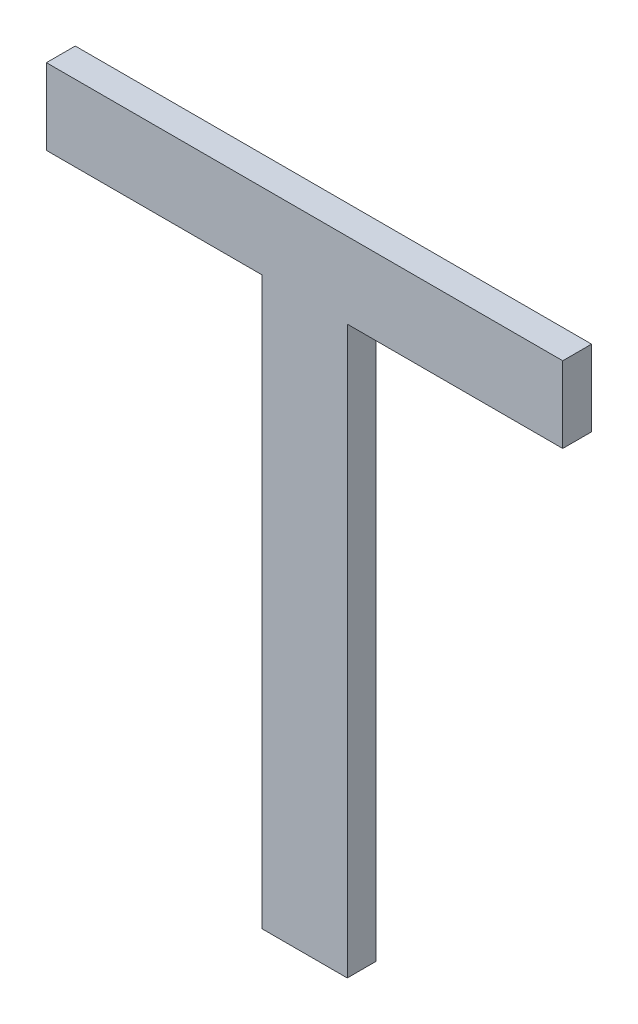
ISO-10303-21;
HEADER;
FILE_DESCRIPTION(('STEP AP214'),'2;1');
FILE_NAME('part.step','',(''),(''),'','','');
FILE_SCHEMA(('AUTOMOTIVE_DESIGN { 1 0 10303 214 1 1 1 1 }'));
ENDSEC;
DATA;
#1=APPLICATION_CONTEXT('core data for automotive mechanical design processes');
#2=APPLICATION_PROTOCOL_DEFINITION('international standard','automotive_design',2000,#1);
#3=PRODUCT_CONTEXT('',#1,'mechanical');
#4=PRODUCT('Part','Part','',(#3));
#5=PRODUCT_RELATED_PRODUCT_CATEGORY('part','',(#4));
#6=PRODUCT_DEFINITION_FORMATION('','',#4);
#7=PRODUCT_DEFINITION_CONTEXT('part definition',#1,'design');
#8=PRODUCT_DEFINITION('design','',#6,#7);
#9=PRODUCT_DEFINITION_SHAPE('','',#8);
#10=(LENGTH_UNIT() NAMED_UNIT(*) SI_UNIT(.MILLI.,.METRE.));
#11=(NAMED_UNIT(*) PLANE_ANGLE_UNIT() SI_UNIT($,.RADIAN.));
#12=(NAMED_UNIT(*) SI_UNIT($,.STERADIAN.) SOLID_ANGLE_UNIT());
#13=UNCERTAINTY_MEASURE_WITH_UNIT(LENGTH_MEASURE(1.E-05),#10,'distance_accuracy_value','');
#14=(GEOMETRIC_REPRESENTATION_CONTEXT(3) GLOBAL_UNCERTAINTY_ASSIGNED_CONTEXT((#13)) GLOBAL_UNIT_ASSIGNED_CONTEXT((#10,
#11,#12)) REPRESENTATION_CONTEXT('',''));
#15=CARTESIAN_POINT('',(0.,0.,0.));
#16=DIRECTION('',(0.,0.,1.));
#17=DIRECTION('',(1.,0.,0.));
#18=AXIS2_PLACEMENT_3D('',#15,#16,#17);
#19=CARTESIAN_POINT('',(-1.2306951468241,-1.3211356147784,0.00415));
#20=DIRECTION('',(0.,0.,1.));
#21=DIRECTION('',(1.,0.,0.));
#22=AXIS2_PLACEMENT_3D('',#19,#20,#21);
#23=PLANE('',#22);
#24=DIRECTION('',(0.,-1.,0.));
#25=VECTOR('',#24,1.);
#26=CARTESIAN_POINT('',(-1.23557926339,-1.3051342008671,0.00415));
#27=LINE('',#26,#25);
#28=CARTESIAN_POINT('',(-1.23557926339,-1.3051342008671,0.00415));
#29=VERTEX_POINT('',#28);
#30=CARTESIAN_POINT('',(-1.23557926339,-1.3699380889616,0.00415));
#31=VERTEX_POINT('',#30);
#32=EDGE_CURVE('E11',#29,#31,#27,.T.);
#33=ORIENTED_EDGE('',*,*,#32,.T.);
#34=DIRECTION('',(1.,0.,0.));
#35=VECTOR('',#34,1.);
#36=CARTESIAN_POINT('',(-1.23557926339,-1.3699380889616,0.00415));
#37=LINE('',#36,#35);
#38=CARTESIAN_POINT('',(-1.2258110302581,-1.3699380889616,0.00415));
#39=VERTEX_POINT('',#38);
#40=EDGE_CURVE('E24',#31,#39,#37,.T.);
#41=ORIENTED_EDGE('',*,*,#40,.T.);
#42=DIRECTION('',(0.,1.,0.));
#43=VECTOR('',#42,1.);
#44=CARTESIAN_POINT('',(-1.2258110302581,-1.3699380889616,0.00415));
#45=LINE('',#44,#43);
#46=CARTESIAN_POINT('',(-1.2258110302581,-1.3051342008671,0.00415));
#47=VERTEX_POINT('',#46);
#48=EDGE_CURVE('E136',#39,#47,#45,.T.);
#49=ORIENTED_EDGE('',*,*,#48,.T.);
#50=DIRECTION('',(1.,0.,0.));
#51=VECTOR('',#50,1.);
#52=CARTESIAN_POINT('',(-1.2258110302581,-1.3051342008671,0.00415));
#53=LINE('',#52,#51);
#54=CARTESIAN_POINT('',(-1.2011521978398,-1.3051342008671,0.00415));
#55=VERTEX_POINT('',#54);
#56=EDGE_CURVE('E134',#47,#55,#53,.T.);
#57=ORIENTED_EDGE('',*,*,#56,.T.);
#58=DIRECTION('',(0.,1.,0.));
#59=VECTOR('',#58,1.);
#60=CARTESIAN_POINT('',(-1.2011521978398,-1.3051342008671,0.00415));
#61=LINE('',#60,#59);
#62=CARTESIAN_POINT('',(-1.2011521978398,-1.2964380908838,0.00415));
#63=VERTEX_POINT('',#62);
#64=EDGE_CURVE('E132',#55,#63,#61,.T.);
#65=ORIENTED_EDGE('',*,*,#64,.T.);
#66=DIRECTION('',(-1.,0.,0.));
#67=VECTOR('',#66,1.);
#68=CARTESIAN_POINT('',(-1.2011521978398,-1.2964380908838,0.00415));
#69=LINE('',#68,#67);
#70=CARTESIAN_POINT('',(-1.2602380958083,-1.2964380908838,0.00415));
#71=VERTEX_POINT('',#70);
#72=EDGE_CURVE('E130',#63,#71,#69,.T.);
#73=ORIENTED_EDGE('',*,*,#72,.T.);
#74=DIRECTION('',(0.,-1.,0.));
#75=VECTOR('',#74,1.);
#76=CARTESIAN_POINT('',(-1.2602380958083,-1.2964380908838,0.00415));
#77=LINE('',#76,#75);
#78=CARTESIAN_POINT('',(-1.2602380958083,-1.3051342008671,0.00415));
#79=VERTEX_POINT('',#78);
#80=EDGE_CURVE('E128',#71,#79,#77,.T.);
#81=ORIENTED_EDGE('',*,*,#80,.T.);
#82=DIRECTION('',(1.,0.,0.));
#83=VECTOR('',#82,1.);
#84=CARTESIAN_POINT('',(-1.2602380958083,-1.3051342008671,0.00415));
#85=LINE('',#84,#83);
#86=EDGE_CURVE('E126',#79,#29,#85,.T.);
#87=ORIENTED_EDGE('',*,*,#86,.T.);
#88=EDGE_LOOP('',(#33,#41,#49,#57,#65,#73,#81,#87));
#89=FACE_BOUND('',#88,.T.);
#90=ADVANCED_FACE('F17',(#89),#23,.T.);
#91=CARTESIAN_POINT('',(-1.2602380958083,-1.3051342008671,0.00085));
#92=DIRECTION('',(0.,-1.,0.));
#93=DIRECTION('',(1.,0.,0.));
#94=AXIS2_PLACEMENT_3D('',#91,#92,#93);
#95=PLANE('',#94);
#96=DIRECTION('',(-1.,0.,0.));
#97=VECTOR('',#96,1.);
#98=CARTESIAN_POINT('',(-1.23557926339,-1.3051342008671,0.00085));
#99=LINE('',#98,#97);
#100=CARTESIAN_POINT('',(-1.23557926339,-1.3051342008671,0.00085));
#101=VERTEX_POINT('',#100);
#102=CARTESIAN_POINT('',(-1.2602380958083,-1.3051342008671,0.00085));
#103=VERTEX_POINT('',#102);
#104=EDGE_CURVE('E124',#101,#103,#99,.T.);
#105=ORIENTED_EDGE('',*,*,#104,.F.);
#106=DIRECTION('',(0.,0.,1.));
#107=VECTOR('',#106,1.);
#108=CARTESIAN_POINT('',(-1.23557926339,-1.3051342008671,0.00085));
#109=LINE('',#108,#107);
#110=EDGE_CURVE('E95',#101,#29,#109,.T.);
#111=ORIENTED_EDGE('',*,*,#110,.T.);
#112=ORIENTED_EDGE('',*,*,#86,.F.);
#113=DIRECTION('',(0.,0.,1.));
#114=VECTOR('',#113,1.);
#115=CARTESIAN_POINT('',(-1.2602380958083,-1.3051342008671,0.00085));
#116=LINE('',#115,#114);
#117=EDGE_CURVE('E120',#103,#79,#116,.T.);
#118=ORIENTED_EDGE('',*,*,#117,.F.);
#119=EDGE_LOOP('',(#105,#111,#112,#118));
#120=FACE_BOUND('',#119,.T.);
#121=ADVANCED_FACE('F163',(#120),#95,.T.);
#122=CARTESIAN_POINT('',(-1.2602380958083,-1.2964380908838,0.00085));
#123=DIRECTION('',(-1.,0.,0.));
#124=DIRECTION('',(0.,-1.,0.));
#125=AXIS2_PLACEMENT_3D('',#122,#123,#124);
#126=PLANE('',#125);
#127=DIRECTION('',(0.,1.,0.));
#128=VECTOR('',#127,1.);
#129=CARTESIAN_POINT('',(-1.2602380958083,-1.3051342008671,0.00085));
#130=LINE('',#129,#128);
#131=CARTESIAN_POINT('',(-1.2602380958083,-1.2964380908838,0.00085));
#132=VERTEX_POINT('',#131);
#133=EDGE_CURVE('E118',#103,#132,#130,.T.);
#134=ORIENTED_EDGE('',*,*,#133,.F.);
#135=ORIENTED_EDGE('',*,*,#117,.T.);
#136=ORIENTED_EDGE('',*,*,#80,.F.);
#137=DIRECTION('',(0.,0.,1.));
#138=VECTOR('',#137,1.);
#139=CARTESIAN_POINT('',(-1.2602380958083,-1.2964380908838,0.00085));
#140=LINE('',#139,#138);
#141=EDGE_CURVE('E115',#132,#71,#140,.T.);
#142=ORIENTED_EDGE('',*,*,#141,.F.);
#143=EDGE_LOOP('',(#134,#135,#136,#142));
#144=FACE_BOUND('',#143,.T.);
#145=ADVANCED_FACE('F160',(#144),#126,.T.);
#146=CARTESIAN_POINT('',(-1.2011521978398,-1.2964380908838,0.00085));
#147=DIRECTION('',(0.,1.,0.));
#148=DIRECTION('',(-1.,0.,0.));
#149=AXIS2_PLACEMENT_3D('',#146,#147,#148);
#150=PLANE('',#149);
#151=DIRECTION('',(1.,0.,0.));
#152=VECTOR('',#151,1.);
#153=CARTESIAN_POINT('',(-1.2602380958083,-1.2964380908838,0.00085));
#154=LINE('',#153,#152);
#155=CARTESIAN_POINT('',(-1.2011521978398,-1.2964380908838,0.00085));
#156=VERTEX_POINT('',#155);
#157=EDGE_CURVE('E113',#132,#156,#154,.T.);
#158=ORIENTED_EDGE('',*,*,#157,.F.);
#159=ORIENTED_EDGE('',*,*,#141,.T.);
#160=ORIENTED_EDGE('',*,*,#72,.F.);
#161=DIRECTION('',(0.,0.,1.));
#162=VECTOR('',#161,1.);
#163=CARTESIAN_POINT('',(-1.2011521978398,-1.2964380908838,0.00085));
#164=LINE('',#163,#162);
#165=EDGE_CURVE('E110',#156,#63,#164,.T.);
#166=ORIENTED_EDGE('',*,*,#165,.F.);
#167=EDGE_LOOP('',(#158,#159,#160,#166));
#168=FACE_BOUND('',#167,.T.);
#169=ADVANCED_FACE('F154',(#168),#150,.T.);
#170=CARTESIAN_POINT('',(-1.2011521978398,-1.3051342008671,0.00085));
#171=DIRECTION('',(1.,0.,0.));
#172=DIRECTION('',(0.,1.,0.));
#173=AXIS2_PLACEMENT_3D('',#170,#171,#172);
#174=PLANE('',#173);
#175=DIRECTION('',(0.,-1.,0.));
#176=VECTOR('',#175,1.);
#177=CARTESIAN_POINT('',(-1.2011521978398,-1.2964380908838,0.00085));
#178=LINE('',#177,#176);
#179=CARTESIAN_POINT('',(-1.2011521978398,-1.3051342008671,0.00085));
#180=VERTEX_POINT('',#179);
#181=EDGE_CURVE('E108',#156,#180,#178,.T.);
#182=ORIENTED_EDGE('',*,*,#181,.F.);
#183=ORIENTED_EDGE('',*,*,#165,.T.);
#184=ORIENTED_EDGE('',*,*,#64,.F.);
#185=DIRECTION('',(0.,0.,1.));
#186=VECTOR('',#185,1.);
#187=CARTESIAN_POINT('',(-1.2011521978398,-1.3051342008671,0.00085));
#188=LINE('',#187,#186);
#189=EDGE_CURVE('E105',#180,#55,#188,.T.);
#190=ORIENTED_EDGE('',*,*,#189,.F.);
#191=EDGE_LOOP('',(#182,#183,#184,#190));
#192=FACE_BOUND('',#191,.T.);
#193=ADVANCED_FACE('F150',(#192),#174,.T.);
#194=CARTESIAN_POINT('',(-1.2258110302581,-1.3051342008671,0.00085));
#195=DIRECTION('',(0.,-1.,0.));
#196=DIRECTION('',(1.,0.,0.));
#197=AXIS2_PLACEMENT_3D('',#194,#195,#196);
#198=PLANE('',#197);
#199=DIRECTION('',(-1.,0.,0.));
#200=VECTOR('',#199,1.);
#201=CARTESIAN_POINT('',(-1.2011521978398,-1.3051342008671,0.00085));
#202=LINE('',#201,#200);
#203=CARTESIAN_POINT('',(-1.2258110302581,-1.3051342008671,0.00085));
#204=VERTEX_POINT('',#203);
#205=EDGE_CURVE('E103',#180,#204,#202,.T.);
#206=ORIENTED_EDGE('',*,*,#205,.F.);
#207=ORIENTED_EDGE('',*,*,#189,.T.);
#208=ORIENTED_EDGE('',*,*,#56,.F.);
#209=DIRECTION('',(0.,0.,1.));
#210=VECTOR('',#209,1.);
#211=CARTESIAN_POINT('',(-1.2258110302581,-1.3051342008671,0.00085));
#212=LINE('',#211,#210);
#213=EDGE_CURVE('E100',#204,#47,#212,.T.);
#214=ORIENTED_EDGE('',*,*,#213,.F.);
#215=EDGE_LOOP('',(#206,#207,#208,#214));
#216=FACE_BOUND('',#215,.T.);
#217=ADVANCED_FACE('F144',(#216),#198,.T.);
#218=CARTESIAN_POINT('',(-1.2258110302581,-1.3699380889616,0.00085));
#219=DIRECTION('',(1.,0.,0.));
#220=DIRECTION('',(0.,1.,0.));
#221=AXIS2_PLACEMENT_3D('',#218,#219,#220);
#222=PLANE('',#221);
#223=DIRECTION('',(0.,-1.,0.));
#224=VECTOR('',#223,1.);
#225=CARTESIAN_POINT('',(-1.2258110302581,-1.3051342008671,0.00085));
#226=LINE('',#225,#224);
#227=CARTESIAN_POINT('',(-1.2258110302581,-1.3699380889616,0.00085));
#228=VERTEX_POINT('',#227);
#229=EDGE_CURVE('E84',#204,#228,#226,.T.);
#230=ORIENTED_EDGE('',*,*,#229,.F.);
#231=ORIENTED_EDGE('',*,*,#213,.T.);
#232=ORIENTED_EDGE('',*,*,#48,.F.);
#233=DIRECTION('',(0.,0.,1.));
#234=VECTOR('',#233,1.);
#235=CARTESIAN_POINT('',(-1.2258110302581,-1.3699380889616,0.00085));
#236=LINE('',#235,#234);
#237=EDGE_CURVE('E88',#228,#39,#236,.T.);
#238=ORIENTED_EDGE('',*,*,#237,.F.);
#239=EDGE_LOOP('',(#230,#231,#232,#238));
#240=FACE_BOUND('',#239,.T.);
#241=ADVANCED_FACE('F140',(#240),#222,.T.);
#242=CARTESIAN_POINT('',(-1.23557926339,-1.3699380889616,0.00085));
#243=DIRECTION('',(0.,-1.,0.));
#244=DIRECTION('',(1.,0.,0.));
#245=AXIS2_PLACEMENT_3D('',#242,#243,#244);
#246=PLANE('',#245);
#247=DIRECTION('',(-1.,0.,0.));
#248=VECTOR('',#247,1.);
#249=CARTESIAN_POINT('',(-1.2258110302581,-1.3699380889616,0.00085));
#250=LINE('',#249,#248);
#251=CARTESIAN_POINT('',(-1.23557926339,-1.3699380889616,0.00085));
#252=VERTEX_POINT('',#251);
#253=EDGE_CURVE('E78',#228,#252,#250,.T.);
#254=ORIENTED_EDGE('',*,*,#253,.F.);
#255=ORIENTED_EDGE('',*,*,#237,.T.);
#256=ORIENTED_EDGE('',*,*,#40,.F.);
#257=DIRECTION('',(0.,0.,1.));
#258=VECTOR('',#257,1.);
#259=CARTESIAN_POINT('',(-1.23557926339,-1.3699380889616,0.00085));
#260=LINE('',#259,#258);
#261=EDGE_CURVE('E89',#252,#31,#260,.T.);
#262=ORIENTED_EDGE('',*,*,#261,.F.);
#263=EDGE_LOOP('',(#254,#255,#256,#262));
#264=FACE_BOUND('',#263,.T.);
#265=ADVANCED_FACE('F91',(#264),#246,.T.);
#266=CARTESIAN_POINT('',(-1.23557926339,-1.3051342008671,0.00085));
#267=DIRECTION('',(-1.,0.,0.));
#268=DIRECTION('',(0.,-1.,0.));
#269=AXIS2_PLACEMENT_3D('',#266,#267,#268);
#270=PLANE('',#269);
#271=DIRECTION('',(0.,1.,0.));
#272=VECTOR('',#271,1.);
#273=CARTESIAN_POINT('',(-1.23557926339,-1.3699380889616,0.00085));
#274=LINE('',#273,#272);
#275=EDGE_CURVE('E82',#252,#101,#274,.T.);
#276=ORIENTED_EDGE('',*,*,#275,.F.);
#277=ORIENTED_EDGE('',*,*,#261,.T.);
#278=ORIENTED_EDGE('',*,*,#32,.F.);
#279=ORIENTED_EDGE('',*,*,#110,.F.);
#280=EDGE_LOOP('',(#276,#277,#278,#279));
#281=FACE_BOUND('',#280,.T.);
#282=ADVANCED_FACE('F93',(#281),#270,.T.);
#283=CARTESIAN_POINT('',(-1.2306951468241,-1.3211356147784,0.00085));
#284=DIRECTION('',(0.,0.,1.));
#285=DIRECTION('',(1.,0.,0.));
#286=AXIS2_PLACEMENT_3D('',#283,#284,#285);
#287=PLANE('',#286);
#288=ORIENTED_EDGE('',*,*,#275,.T.);
#289=ORIENTED_EDGE('',*,*,#104,.T.);
#290=ORIENTED_EDGE('',*,*,#133,.T.);
#291=ORIENTED_EDGE('',*,*,#157,.T.);
#292=ORIENTED_EDGE('',*,*,#181,.T.);
#293=ORIENTED_EDGE('',*,*,#205,.T.);
#294=ORIENTED_EDGE('',*,*,#229,.T.);
#295=ORIENTED_EDGE('',*,*,#253,.T.);
#296=EDGE_LOOP('',(#288,#289,#290,#291,#292,#293,#294,#295));
#297=FACE_BOUND('',#296,.T.);
#298=ADVANCED_FACE('F80',(#297),#287,.F.);
#299=CLOSED_SHELL('',(#90,#121,#145,#169,#193,#217,#241,#265,#282,#298));
#300=MANIFOLD_SOLID_BREP('B1',#299);
#301=ADVANCED_BREP_SHAPE_REPRESENTATION('',(#18,#300),#14);
#302=SHAPE_DEFINITION_REPRESENTATION(#9,#301);
ENDSEC;
END-ISO-10303-21;
